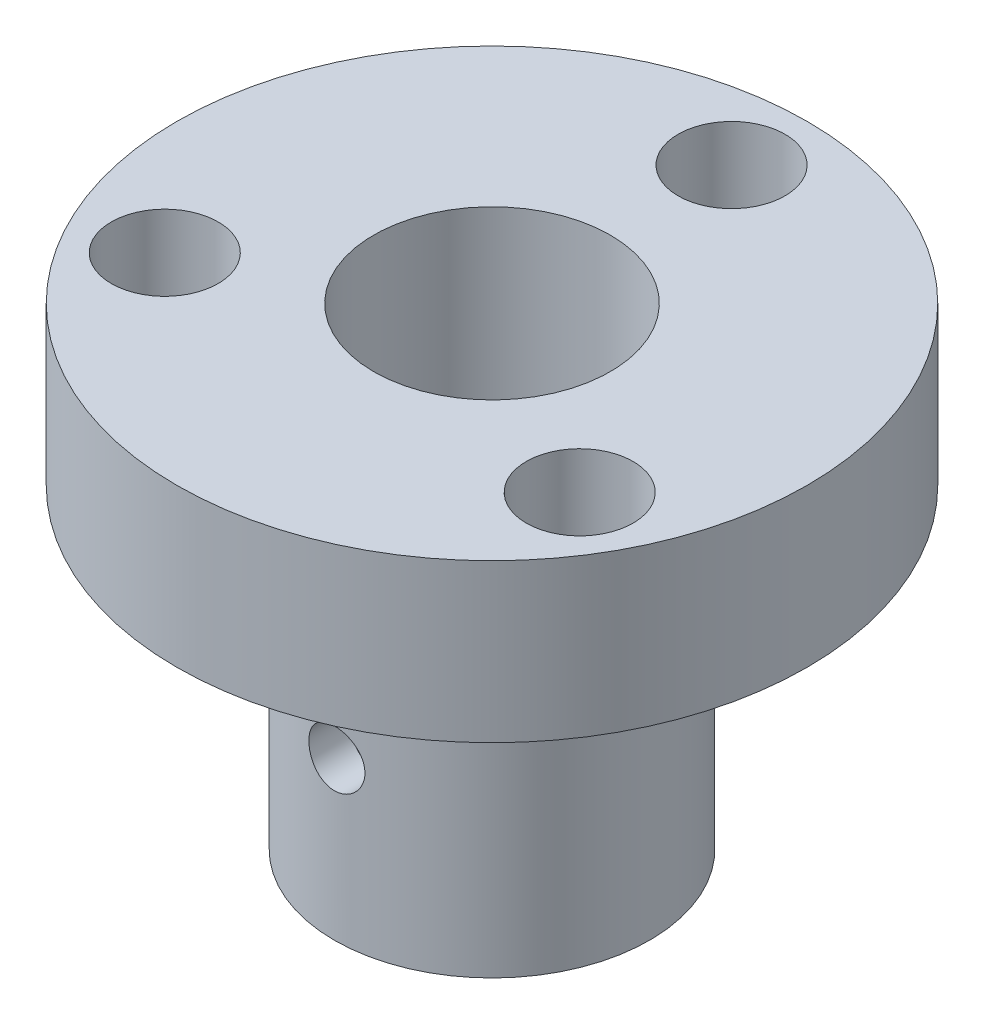
ISO-10303-21;
HEADER;
FILE_DESCRIPTION(('STEP AP214'),'2;1');
FILE_NAME('part.step','',(''),(''),'','','');
FILE_SCHEMA(('AUTOMOTIVE_DESIGN { 1 0 10303 214 1 1 1 1 }'));
ENDSEC;
DATA;
#1=APPLICATION_CONTEXT('core data for automotive mechanical design processes');
#2=APPLICATION_PROTOCOL_DEFINITION('international standard','automotive_design',2000,#1);
#3=PRODUCT_CONTEXT('',#1,'mechanical');
#4=PRODUCT('Part','Part','',(#3));
#5=PRODUCT_RELATED_PRODUCT_CATEGORY('part','',(#4));
#6=PRODUCT_DEFINITION_FORMATION('','',#4);
#7=PRODUCT_DEFINITION_CONTEXT('part definition',#1,'design');
#8=PRODUCT_DEFINITION('design','',#6,#7);
#9=PRODUCT_DEFINITION_SHAPE('','',#8);
#10=(LENGTH_UNIT() NAMED_UNIT(*) SI_UNIT(.MILLI.,.METRE.));
#11=(NAMED_UNIT(*) PLANE_ANGLE_UNIT() SI_UNIT($,.RADIAN.));
#12=(NAMED_UNIT(*) SI_UNIT($,.STERADIAN.) SOLID_ANGLE_UNIT());
#13=UNCERTAINTY_MEASURE_WITH_UNIT(LENGTH_MEASURE(1.E-05),#10,'distance_accuracy_value','');
#14=(GEOMETRIC_REPRESENTATION_CONTEXT(3) GLOBAL_UNCERTAINTY_ASSIGNED_CONTEXT((#13)) GLOBAL_UNIT_ASSIGNED_CONTEXT((#10,
#11,#12)) REPRESENTATION_CONTEXT('',''));
#15=CARTESIAN_POINT('',(0.,0.,0.));
#16=DIRECTION('',(0.,0.,1.));
#17=DIRECTION('',(1.,0.,0.));
#18=AXIS2_PLACEMENT_3D('',#15,#16,#17);
#19=CARTESIAN_POINT('',(0.,12.7,0.));
#20=DIRECTION('',(0.,-1.,0.));
#21=DIRECTION('',(0.,0.,-1.));
#22=AXIS2_PLACEMENT_3D('',#19,#20,#21);
#23=CYLINDRICAL_SURFACE('',#22,6.35);
#24=CARTESIAN_POINT('',(-1.1303,6.35,6.2485935945619));
#25=CARTESIAN_POINT('',(-1.13029752860319,6.4129474816605,6.24859477928636));
#26=CARTESIAN_POINT('',(-1.12502376655344,6.47592772669888,6.24955510147455));
#27=CARTESIAN_POINT('',(-1.10407989662448,6.60011645744907,6.253288450742));
#28=CARTESIAN_POINT('',(-1.08840060868597,6.66132332883139,6.25606307842284));
#29=CARTESIAN_POINT('',(-1.04713896619609,6.78015026397906,6.26310106017997));
#30=CARTESIAN_POINT('',(-1.02156538976728,6.83777345470071,6.26736309431536));
#31=CARTESIAN_POINT('',(-0.961263736790337,6.94790652333615,6.27689410394911));
#32=CARTESIAN_POINT('',(-0.926536522350173,7.00041688214925,6.28216298460781));
#33=CARTESIAN_POINT('',(-0.848497662550804,7.09942825016859,6.29318010060458));
#34=CARTESIAN_POINT('',(-0.80510320914681,7.14586352406258,6.29893262327816));
#35=CARTESIAN_POINT('',(-0.711140656114693,7.23083469001617,6.31023089151142));
#36=CARTESIAN_POINT('',(-0.66057210782028,7.26937008765047,6.31577662411108));
#37=CARTESIAN_POINT('',(-0.553267727306871,7.33769713569882,6.3260821366722));
#38=CARTESIAN_POINT('',(-0.496492076393623,7.36742717538406,6.33083628120179));
#39=CARTESIAN_POINT('',(-0.37865347562094,7.41690308225444,6.33897509325521));
#40=CARTESIAN_POINT('',(-0.317590843835827,7.4366496892748,6.34235986225469));
#41=CARTESIAN_POINT('',(-0.193591929496425,7.4653959469096,6.34734827608291));
#42=CARTESIAN_POINT('',(-0.130682049247929,7.47450625308372,6.34897024782024));
#43=CARTESIAN_POINT('',(-0.00420718696587975,7.4820657608453,6.35031338922828));
#44=CARTESIAN_POINT('',(0.0593577441923803,7.48051578423726,6.35003470542113));
#45=CARTESIAN_POINT('',(0.184580543784089,7.46688426227889,6.34762234490442));
#46=CARTESIAN_POINT('',(0.246251841595396,7.45492183576534,6.34550965008509));
#47=CARTESIAN_POINT('',(0.366697607884809,7.42099299078743,6.33969011077832));
#48=CARTESIAN_POINT('',(0.425471978630505,7.39902623506687,6.33598321254887));
#49=CARTESIAN_POINT('',(0.538805120450369,7.34559650342699,6.32735638635074));
#50=CARTESIAN_POINT('',(0.593340631871781,7.31408522290982,6.32243031191731));
#51=CARTESIAN_POINT('',(0.696394590932209,7.24249642495821,6.31191110570192));
#52=CARTESIAN_POINT('',(0.744912484459761,7.20241811958306,6.30631791258354));
#53=CARTESIAN_POINT('',(0.835258832297386,7.11417450408075,6.29499388871477));
#54=CARTESIAN_POINT('',(0.876985499299346,7.06590502301524,6.28926222422367));
#55=CARTESIAN_POINT('',(0.951765111250197,6.96299812033823,6.27838159660169));
#56=CARTESIAN_POINT('',(0.984817952788774,6.90836062281775,6.27323264041835));
#57=CARTESIAN_POINT('',(1.04133641697596,6.79414166467476,6.26409955120621));
#58=CARTESIAN_POINT('',(1.06478844399584,6.73455333578239,6.26011707226906));
#59=CARTESIAN_POINT('',(1.10132048259893,6.61219582604084,6.25379407198502));
#60=CARTESIAN_POINT('',(1.11440154509544,6.54942696816782,6.25145338427448));
#61=CARTESIAN_POINT('',(1.12967421074342,6.42340468476552,6.24871157429963));
#62=CARTESIAN_POINT('',(1.1320115149774,6.36016946405966,6.24828450262102));
#63=CARTESIAN_POINT('',(1.12611980656729,6.23421190744061,6.24934899119854));
#64=CARTESIAN_POINT('',(1.11789126229031,6.17148954891709,6.25084046640858));
#65=CARTESIAN_POINT('',(1.09122611970099,6.0488095478001,6.25554991782972));
#66=CARTESIAN_POINT('',(1.0728648576672,5.98883499749475,6.25875514695102));
#67=CARTESIAN_POINT('',(1.02653498701514,5.87281385159103,6.26652011136834));
#68=CARTESIAN_POINT('',(0.998565732092789,5.81676752053895,6.27107993778172));
#69=CARTESIAN_POINT('',(0.933474479097979,5.70954878726828,6.28109997867828));
#70=CARTESIAN_POINT('',(0.896259814835744,5.65843349045936,6.28656911125703));
#71=CARTESIAN_POINT('',(0.813860130740536,5.56312065938619,6.29776598333192));
#72=CARTESIAN_POINT('',(0.768674468015051,5.51892368365494,6.30349374365968));
#73=CARTESIAN_POINT('',(0.670967135208993,5.43816353360303,6.3146452745759));
#74=CARTESIAN_POINT('',(0.618364201269163,5.40169796577111,6.3200645909399));
#75=CARTESIAN_POINT('',(0.507694087392308,5.33812217243745,6.32991535892806));
#76=CARTESIAN_POINT('',(0.449627102767369,5.31101161270319,6.33434684584306));
#77=CARTESIAN_POINT('',(0.329956377996444,5.2670642471255,6.34170339516869));
#78=CARTESIAN_POINT('',(0.26837124516651,5.25017803607877,6.34463569095833));
#79=CARTESIAN_POINT('',(0.143182328625897,5.22700033003815,6.34869419748068));
#80=CARTESIAN_POINT('',(0.0795787360337635,5.22070783500608,6.34982057868977));
#81=CARTESIAN_POINT('',(-0.0469027850895825,5.2189281674832,6.35013741439244));
#82=CARTESIAN_POINT('',(-0.109778614269502,5.2232930711384,6.3493543717336));
#83=CARTESIAN_POINT('',(-0.233886077679075,5.24238221219445,6.34599495704242));
#84=CARTESIAN_POINT('',(-0.295117724437979,5.25710637063087,6.34341859867981));
#85=CARTESIAN_POINT('',(-0.414130647219045,5.29643628901858,6.3367614767518));
#86=CARTESIAN_POINT('',(-0.471916767035402,5.32102778217131,6.33268288590209));
#87=CARTESIAN_POINT('',(-0.582565157591162,5.37937720115281,6.32346454814741));
#88=CARTESIAN_POINT('',(-0.635427142672245,5.41313565833019,6.31832473973479));
#89=CARTESIAN_POINT('',(-0.735467702991129,5.48937711212491,6.30746821917931));
#90=CARTESIAN_POINT('',(-0.782563586469942,5.5319676821887,6.3017448838471));
#91=CARTESIAN_POINT('',(-0.868991600851841,5.62443981221691,6.29041003362776));
#92=CARTESIAN_POINT('',(-0.908321908493049,5.67432307964371,6.28479854527831));
#93=CARTESIAN_POINT('',(-0.978402705974915,5.78045289515873,6.2742726933168));
#94=CARTESIAN_POINT('',(-1.00908013748217,5.83674830361509,6.26936442851344));
#95=CARTESIAN_POINT('',(-1.06049430719683,5.95376063547626,6.26087346378715));
#96=CARTESIAN_POINT('',(-1.08124068756143,6.01447320395225,6.25728947888211));
#97=CARTESIAN_POINT('',(-1.10785061597257,6.12116068175458,6.2526226773509));
#98=CARTESIAN_POINT('',(-1.116255146414,6.16650046594738,6.2511204717796));
#99=CARTESIAN_POINT('',(-1.12748067941379,6.25788766220765,6.24910550811149));
#100=CARTESIAN_POINT('',(-1.13030180856719,6.30393505820726,6.24859272758101));
#101=CARTESIAN_POINT('',(-1.1303,6.35,6.2485935945619));
#102=B_SPLINE_CURVE_WITH_KNOTS('',3,(#24,#25,#26,#27,#28,#29,#30,#31,#32,#33,#34,#35,#36,#37,
#38,#39,#40,#41,#42,#43,#44,#45,#46,#47,#48,#49,#50,#51,#52,#53,#54,#55,#56,#57,#58,#59,#60,#61,
#62,#63,#64,#65,#66,#67,#68,#69,#70,#71,#72,#73,#74,#75,#76,#77,#78,#79,#80,#81,#82,#83,#84,#85,
#86,#87,#88,#89,#90,#91,#92,#93,#94,#95,#96,#97,#98,#99,#100,#101),.UNSPECIFIED.,.T.,.F.,(4,2,2,
2,2,2,2,2,2,2,2,2,2,2,2,2,2,2,2,2,2,2,2,2,2,2,2,2,2,2,2,2,2,2,2,2,2,2,4),(0.,0.188673929647673,
0.377514534626136,0.566187984707758,0.754843671490905,0.945396353842151,1.13596095857323,
1.32782903745417,1.51968289561749,1.70952248173693,1.89934743322768,2.08702890424999,
2.27471670267542,2.46337072228333,2.65204210056538,2.84332262546283,3.03460543072442,
3.22615818062714,3.41769151757453,3.60661956640559,3.79553924064846,3.98307286921062,
4.17061911513112,4.36012684649338,4.54964986939678,4.74143924348983,4.93322176468821,
5.12407001760689,5.3149002535955,5.5030968753489,5.69129206257059,5.87921612052189,
6.06715107352076,6.25752581883362,6.44794520878683,6.6399272609008,6.83172253573712,
6.96979717232728,7.10786867825189),.UNSPECIFIED.);
#103=CARTESIAN_POINT('',(-1.1303,6.35,6.2485935945619));
#104=VERTEX_POINT('',#103);
#105=EDGE_CURVE('E37',#104,#104,#102,.T.);
#106=ORIENTED_EDGE('',*,*,#105,.T.);
#107=EDGE_LOOP('',(#106));
#108=FACE_BOUND('',#107,.T.);
#109=CARTESIAN_POINT('',(0.,12.7,0.));
#110=DIRECTION('',(0.,1.,0.));
#111=DIRECTION('',(0.,0.,1.));
#112=AXIS2_PLACEMENT_3D('',#109,#110,#111);
#113=CIRCLE('',#112,6.35);
#114=CARTESIAN_POINT('',(0.,12.7,6.35));
#115=VERTEX_POINT('',#114);
#116=EDGE_CURVE('E10',#115,#115,#113,.T.);
#117=ORIENTED_EDGE('',*,*,#116,.F.);
#118=EDGE_LOOP('',(#117));
#119=FACE_BOUND('',#118,.T.);
#120=CARTESIAN_POINT('',(0.,0.,0.));
#121=DIRECTION('',(0.,1.,0.));
#122=DIRECTION('',(0.,0.,1.));
#123=AXIS2_PLACEMENT_3D('',#120,#121,#122);
#124=CIRCLE('',#123,6.35);
#125=CARTESIAN_POINT('',(0.,0.,6.35));
#126=VERTEX_POINT('',#125);
#127=EDGE_CURVE('E44',#126,#126,#124,.T.);
#128=ORIENTED_EDGE('',*,*,#127,.T.);
#129=EDGE_LOOP('',(#128));
#130=FACE_BOUND('',#129,.T.);
#131=ADVANCED_FACE('F33',(#108,#119,#130),#23,.T.);
#132=CARTESIAN_POINT('',(0.,0.,0.));
#133=DIRECTION('',(0.,1.,0.));
#134=DIRECTION('',(0.,0.,1.));
#135=AXIS2_PLACEMENT_3D('',#132,#133,#134);
#136=PLANE('',#135);
#137=CARTESIAN_POINT('',(0.,0.,0.));
#138=DIRECTION('',(0.,1.,0.));
#139=DIRECTION('',(0.,0.,1.));
#140=AXIS2_PLACEMENT_3D('',#137,#138,#139);
#141=CIRCLE('',#140,4.76758);
#142=CARTESIAN_POINT('',(0.,0.,4.76758));
#143=VERTEX_POINT('',#142);
#144=EDGE_CURVE('E54',#143,#143,#141,.T.);
#145=ORIENTED_EDGE('',*,*,#144,.T.);
#146=EDGE_LOOP('',(#145));
#147=FACE_BOUND('',#146,.T.);
#148=ORIENTED_EDGE('',*,*,#127,.F.);
#149=EDGE_LOOP('',(#148));
#150=FACE_BOUND('',#149,.T.);
#151=ADVANCED_FACE('F112',(#147,#150),#136,.F.);
#152=CARTESIAN_POINT('',(0.,12.7,0.));
#153=DIRECTION('',(0.,1.,0.));
#154=DIRECTION('',(0.,0.,1.));
#155=AXIS2_PLACEMENT_3D('',#152,#153,#154);
#156=PLANE('',#155);
#157=CARTESIAN_POINT('',(0.,12.7,-9.652));
#158=DIRECTION('',(0.,1.,0.));
#159=DIRECTION('',(0.,0.,1.));
#160=AXIS2_PLACEMENT_3D('',#157,#158,#159);
#161=CIRCLE('',#160,2.15265);
#162=CARTESIAN_POINT('',(0.,12.7,-7.49935));
#163=VERTEX_POINT('',#162);
#164=EDGE_CURVE('E74',#163,#163,#161,.T.);
#165=ORIENTED_EDGE('',*,*,#164,.T.);
#166=EDGE_LOOP('',(#165));
#167=FACE_BOUND('',#166,.T.);
#168=CARTESIAN_POINT('',(-8.35887719732738,12.7,4.82600000000004));
#169=DIRECTION('',(0.,1.,0.));
#170=DIRECTION('',(0.,0.,1.));
#171=AXIS2_PLACEMENT_3D('',#168,#169,#170);
#172=CIRCLE('',#171,2.15265);
#173=CARTESIAN_POINT('',(-8.35887719732738,12.7,6.97865000000004));
#174=VERTEX_POINT('',#173);
#175=EDGE_CURVE('E68',#174,#174,#172,.T.);
#176=ORIENTED_EDGE('',*,*,#175,.T.);
#177=EDGE_LOOP('',(#176));
#178=FACE_BOUND('',#177,.T.);
#179=CARTESIAN_POINT('',(8.35887719732738,12.7,4.82600000000004));
#180=DIRECTION('',(0.,1.,0.));
#181=DIRECTION('',(0.,0.,1.));
#182=AXIS2_PLACEMENT_3D('',#179,#180,#181);
#183=CIRCLE('',#182,2.15265);
#184=CARTESIAN_POINT('',(8.35887719732738,12.7,6.97865000000003));
#185=VERTEX_POINT('',#184);
#186=EDGE_CURVE('E60',#185,#185,#183,.T.);
#187=ORIENTED_EDGE('',*,*,#186,.T.);
#188=EDGE_LOOP('',(#187));
#189=FACE_BOUND('',#188,.T.);
#190=CARTESIAN_POINT('',(0.,12.7,0.));
#191=DIRECTION('',(0.,1.,0.));
#192=DIRECTION('',(0.,0.,1.));
#193=AXIS2_PLACEMENT_3D('',#190,#191,#192);
#194=CIRCLE('',#193,12.7);
#195=CARTESIAN_POINT('',(0.,12.7,12.7));
#196=VERTEX_POINT('',#195);
#197=EDGE_CURVE('E51',#196,#196,#194,.T.);
#198=ORIENTED_EDGE('',*,*,#197,.F.);
#199=EDGE_LOOP('',(#198));
#200=FACE_BOUND('',#199,.T.);
#201=ORIENTED_EDGE('',*,*,#116,.T.);
#202=EDGE_LOOP('',(#201));
#203=FACE_BOUND('',#202,.T.);
#204=ADVANCED_FACE('F117',(#167,#178,#189,#200,#203),#156,.F.);
#205=CARTESIAN_POINT('',(0.,19.05,0.));
#206=DIRECTION('',(0.,-1.,0.));
#207=DIRECTION('',(0.,0.,-1.));
#208=AXIS2_PLACEMENT_3D('',#205,#206,#207);
#209=CYLINDRICAL_SURFACE('',#208,12.7);
#210=CARTESIAN_POINT('',(0.,19.05,0.));
#211=DIRECTION('',(0.,1.,0.));
#212=DIRECTION('',(0.,0.,1.));
#213=AXIS2_PLACEMENT_3D('',#210,#211,#212);
#214=CIRCLE('',#213,12.7);
#215=CARTESIAN_POINT('',(0.,19.05,12.7));
#216=VERTEX_POINT('',#215);
#217=EDGE_CURVE('E49',#216,#216,#214,.T.);
#218=ORIENTED_EDGE('',*,*,#217,.F.);
#219=EDGE_LOOP('',(#218));
#220=FACE_BOUND('',#219,.T.);
#221=ORIENTED_EDGE('',*,*,#197,.T.);
#222=EDGE_LOOP('',(#221));
#223=FACE_BOUND('',#222,.T.);
#224=ADVANCED_FACE('F135',(#220,#223),#209,.T.);
#225=CARTESIAN_POINT('',(0.,19.05,0.));
#226=DIRECTION('',(0.,1.,0.));
#227=DIRECTION('',(0.,0.,1.));
#228=AXIS2_PLACEMENT_3D('',#225,#226,#227);
#229=PLANE('',#228);
#230=CARTESIAN_POINT('',(0.,19.05,-9.652));
#231=DIRECTION('',(0.,1.,0.));
#232=DIRECTION('',(0.,0.,1.));
#233=AXIS2_PLACEMENT_3D('',#230,#231,#232);
#234=CIRCLE('',#233,2.15265);
#235=CARTESIAN_POINT('',(0.,19.05,-7.49935));
#236=VERTEX_POINT('',#235);
#237=EDGE_CURVE('E77',#236,#236,#234,.T.);
#238=ORIENTED_EDGE('',*,*,#237,.F.);
#239=EDGE_LOOP('',(#238));
#240=FACE_BOUND('',#239,.T.);
#241=CARTESIAN_POINT('',(-8.35887719732738,19.05,4.82600000000004));
#242=DIRECTION('',(0.,1.,0.));
#243=DIRECTION('',(0.,0.,1.));
#244=AXIS2_PLACEMENT_3D('',#241,#242,#243);
#245=CIRCLE('',#244,2.15265);
#246=CARTESIAN_POINT('',(-8.35887719732738,19.05,6.97865000000004));
#247=VERTEX_POINT('',#246);
#248=EDGE_CURVE('E71',#247,#247,#245,.T.);
#249=ORIENTED_EDGE('',*,*,#248,.F.);
#250=EDGE_LOOP('',(#249));
#251=FACE_BOUND('',#250,.T.);
#252=CARTESIAN_POINT('',(8.35887719732738,19.05,4.82600000000004));
#253=DIRECTION('',(0.,1.,0.));
#254=DIRECTION('',(0.,0.,1.));
#255=AXIS2_PLACEMENT_3D('',#252,#253,#254);
#256=CIRCLE('',#255,2.15265);
#257=CARTESIAN_POINT('',(8.35887719732738,19.05,6.97865000000004));
#258=VERTEX_POINT('',#257);
#259=EDGE_CURVE('E65',#258,#258,#256,.T.);
#260=ORIENTED_EDGE('',*,*,#259,.F.);
#261=EDGE_LOOP('',(#260));
#262=FACE_BOUND('',#261,.T.);
#263=CARTESIAN_POINT('',(0.,19.05,0.));
#264=DIRECTION('',(0.,1.,0.));
#265=DIRECTION('',(0.,0.,1.));
#266=AXIS2_PLACEMENT_3D('',#263,#264,#265);
#267=CIRCLE('',#266,4.76758);
#268=CARTESIAN_POINT('',(0.,19.05,4.76758));
#269=VERTEX_POINT('',#268);
#270=EDGE_CURVE('E57',#269,#269,#267,.T.);
#271=ORIENTED_EDGE('',*,*,#270,.F.);
#272=EDGE_LOOP('',(#271));
#273=FACE_BOUND('',#272,.T.);
#274=ORIENTED_EDGE('',*,*,#217,.T.);
#275=EDGE_LOOP('',(#274));
#276=FACE_BOUND('',#275,.T.);
#277=ADVANCED_FACE('F108',(#240,#251,#262,#273,#276),#229,.T.);
#278=CARTESIAN_POINT('',(0.,0.,0.));
#279=DIRECTION('',(0.,1.,0.));
#280=DIRECTION('',(0.,0.,1.));
#281=AXIS2_PLACEMENT_3D('',#278,#279,#280);
#282=CYLINDRICAL_SURFACE('',#281,4.76758);
#283=CARTESIAN_POINT('',(0.,5.2197,4.76758));
#284=CARTESIAN_POINT('',(0.0625524058414924,5.21970193084232,4.76757888568314));
#285=CARTESIAN_POINT('',(0.125127098186318,5.22491010852738,4.76633656256058));
#286=CARTESIAN_POINT('',(0.248489906553298,5.24557812898572,4.76150089246402));
#287=CARTESIAN_POINT('',(0.309276871940467,5.26104442964688,4.75790606451563));
#288=CARTESIAN_POINT('',(0.427264355908841,5.30170982285277,4.74876439603588));
#289=CARTESIAN_POINT('',(0.484468858607829,5.32689787195789,4.74321977101343));
#290=CARTESIAN_POINT('',(0.593839483970573,5.38625450470629,4.7307723835204));
#291=CARTESIAN_POINT('',(0.646005562892928,5.42042316630575,4.72386960926053));
#292=CARTESIAN_POINT('',(0.744792782155422,5.49744513336606,4.70931421092425));
#293=CARTESIAN_POINT('',(0.79130647566178,5.54043425116134,4.70165096826963));
#294=CARTESIAN_POINT('',(0.87653563067149,5.63358571343386,4.68651066945842));
#295=CARTESIAN_POINT('',(0.915250294982354,5.68374879031566,4.67903363240358));
#296=CARTESIAN_POINT('',(0.984274306941059,5.79064143644958,4.66500633104685));
#297=CARTESIAN_POINT('',(1.01446595185179,5.84744894683104,4.6584696037687));
#298=CARTESIAN_POINT('',(1.06483080775784,5.96551252756314,4.64721689515964));
#299=CARTESIAN_POINT('',(1.08500544481656,6.02676796326432,4.64250065467785));
#300=CARTESIAN_POINT('',(1.11440193281012,6.15081370645423,4.6355316478263));
#301=CARTESIAN_POINT('',(1.12381573956728,6.21355604741308,4.63323576593506));
#302=CARTESIAN_POINT('',(1.1320208236683,6.33976825482429,4.63123818803435));
#303=CARTESIAN_POINT('',(1.130813645728,6.40323801413996,4.63153611478132));
#304=CARTESIAN_POINT('',(1.11796474417215,6.52765141751584,4.63465361511795));
#305=CARTESIAN_POINT('',(1.10654925432487,6.58862000731689,4.63741851340828));
#306=CARTESIAN_POINT('',(1.07396760577446,6.70775117149921,4.64507158654718));
#307=CARTESIAN_POINT('',(1.05280081515946,6.76591356376107,4.64995989899782));
#308=CARTESIAN_POINT('',(1.00111828869584,6.87840047613239,4.66136076625657));
#309=CARTESIAN_POINT('',(0.970518369318639,6.9326847842406,4.66788784431785));
#310=CARTESIAN_POINT('',(0.900897207532268,7.03543039157134,4.68182230972949));
#311=CARTESIAN_POINT('',(0.861874629480849,7.0838907653506,4.68922983661522));
#312=CARTESIAN_POINT('',(0.775332959887324,7.17491202601966,4.70432266185229));
#313=CARTESIAN_POINT('',(0.727622310008605,7.21729061493288,4.71201022244166));
#314=CARTESIAN_POINT('',(0.625681099872622,7.29347779676572,4.72662559567478));
#315=CARTESIAN_POINT('',(0.571450377968597,7.32728617714664,4.73355338947412));
#316=CARTESIAN_POINT('',(0.457764489292095,7.38543067934072,4.74589770143639));
#317=CARTESIAN_POINT('',(0.398294934195047,7.40973965024404,4.75130987538831));
#318=CARTESIAN_POINT('',(0.275957341437764,7.44796659236006,4.75998131439382));
#319=CARTESIAN_POINT('',(0.213089888665993,7.46188634582398,4.76324094870058));
#320=CARTESIAN_POINT('',(0.0873018412734605,7.47866701359783,4.76718628173408));
#321=CARTESIAN_POINT('',(0.0244161742552055,7.48177649869878,4.7679298244795));
#322=CARTESIAN_POINT('',(-0.100976449140018,7.47752668688891,4.7669228094121));
#323=CARTESIAN_POINT('',(-0.163483435563953,7.47016823179389,4.76517245215489));
#324=CARTESIAN_POINT('',(-0.285497778788292,7.44539690567029,4.7594111428399));
#325=CARTESIAN_POINT('',(-0.345033756336252,7.42811740541598,4.7554301938918));
#326=CARTESIAN_POINT('',(-0.460360538553933,7.38414498120892,4.74565481028302));
#327=CARTESIAN_POINT('',(-0.516150987842508,7.35745116551064,4.7398602038344));
#328=CARTESIAN_POINT('',(-0.623408758447266,7.29491072700109,4.72695978364888));
#329=CARTESIAN_POINT('',(-0.674790755293286,7.25892195916578,4.7198341304949));
#330=CARTESIAN_POINT('',(-0.77087496417983,7.17899719542512,4.70509700215467));
#331=CARTESIAN_POINT('',(-0.815576143975616,7.13505997372744,4.69748545215185));
#332=CARTESIAN_POINT('',(-0.898036628852286,7.03933666938004,4.68242971168702));
#333=CARTESIAN_POINT('',(-0.935622452191612,6.98739975905363,4.67499283784952));
#334=CARTESIAN_POINT('',(-1.00154193624881,6.87780687164487,4.66131640938934));
#335=CARTESIAN_POINT('',(-1.02987601093222,6.82015115059881,4.65507680120068));
#336=CARTESIAN_POINT('',(-1.07628281730024,6.701072026035,4.64456680434952));
#337=CARTESIAN_POINT('',(-1.09441585682302,6.6396731962946,4.64028487085787));
#338=CARTESIAN_POINT('',(-1.12007359207612,6.51458316456753,4.63415919448729));
#339=CARTESIAN_POINT('',(-1.12760033375709,6.4508924071244,4.63231498137733));
#340=CARTESIAN_POINT('',(-1.13173320157672,6.32478453572057,4.6313067861145));
#341=CARTESIAN_POINT('',(-1.12861558580075,6.26237686457289,4.63207500030485));
#342=CARTESIAN_POINT('',(-1.11217421706066,6.13900394749625,4.63604979910636));
#343=CARTESIAN_POINT('',(-1.09885063072876,6.07803867803405,4.63925634390704));
#344=CARTESIAN_POINT('',(-1.06251919408861,5.95954685975541,4.64771069318547));
#345=CARTESIAN_POINT('',(-1.0395582040923,5.90200518969512,4.65294861119475));
#346=CARTESIAN_POINT('',(-0.984641788092935,5.7915521880276,4.66487788538148));
#347=CARTESIAN_POINT('',(-0.952685242843283,5.73864143368361,4.67156942239771));
#348=CARTESIAN_POINT('',(-0.879797350919583,5.63760556507867,4.68584925686423));
#349=CARTESIAN_POINT('',(-0.838672053752488,5.58962280618225,4.69345498656145));
#350=CARTESIAN_POINT('',(-0.748998593231899,5.50114934265285,4.70859681825466));
#351=CARTESIAN_POINT('',(-0.700448693828069,5.46066039515966,4.71613290352794));
#352=CARTESIAN_POINT('',(-0.596376595118508,5.38770315899086,4.73042842717735));
#353=CARTESIAN_POINT('',(-0.540756166309731,5.35537202460958,4.73717367827902));
#354=CARTESIAN_POINT('',(-0.42471762177434,5.30057006701792,4.748981317852));
#355=CARTESIAN_POINT('',(-0.364303241554323,5.27809165384223,4.75404500097436));
#356=CARTESIAN_POINT('',(-0.253266860984691,5.24726017254508,4.761103169873));
#357=CARTESIAN_POINT('',(-0.203206673031568,5.23694629143181,4.76351601464223));
#358=CARTESIAN_POINT('',(-0.102102566457941,5.22316562468425,4.76675483638665));
#359=CARTESIAN_POINT('',(-0.0510587076662017,5.2196984239405,4.7675809095666));
#360=CARTESIAN_POINT('',(0.,5.2197,4.76758));
#361=B_SPLINE_CURVE_WITH_KNOTS('',3,(#283,#284,#285,#286,#287,#288,#289,#290,#291,#292,#293,
#294,#295,#296,#297,#298,#299,#300,#301,#302,#303,#304,#305,#306,#307,#308,#309,#310,#311,#312,
#313,#314,#315,#316,#317,#318,#319,#320,#321,#322,#323,#324,#325,#326,#327,#328,#329,#330,#331,
#332,#333,#334,#335,#336,#337,#338,#339,#340,#341,#342,#343,#344,#345,#346,#347,#348,#349,#350,
#351,#352,#353,#354,#355,#356,#357,#358,#359,#360),.UNSPECIFIED.,.T.,.F.,(4,2,2,2,2,2,2,2,2,2,2,
2,2,2,2,2,2,2,2,2,2,2,2,2,2,2,2,2,2,2,2,2,2,2,2,2,2,2,4),(0.,0.187470200794151,
0.375058533542777,0.56243439914393,0.749811891314547,0.940326241693303,1.13086005598579,
1.32390905636407,1.51693056558797,1.70645234650946,1.89594656384171,2.08134256770728,
2.26675058744879,2.45386363233188,2.64100637091985,2.83292906546866,3.02485651917985,
3.21732859029974,3.40976763559459,3.59775137378109,3.78571999545652,3.97121898015836,
4.15673554047055,4.34527706333458,4.53384768746529,4.7265483377905,4.91924036462547,
5.11078090400512,5.30228449023071,5.48885607848821,5.67542462066832,5.86109632437587,
6.04679113998049,6.23686695298859,6.42698727843469,6.62011805032187,6.81309978285714,
6.96613253108733,7.11915600076375),.UNSPECIFIED.);
#362=CARTESIAN_POINT('',(0.,5.2197,4.76758));
#363=VERTEX_POINT('',#362);
#364=EDGE_CURVE('E80',#363,#363,#361,.T.);
#365=ORIENTED_EDGE('',*,*,#364,.T.);
#366=EDGE_LOOP('',(#365));
#367=FACE_BOUND('',#366,.T.);
#368=ORIENTED_EDGE('',*,*,#144,.F.);
#369=EDGE_LOOP('',(#368));
#370=FACE_BOUND('',#369,.T.);
#371=ORIENTED_EDGE('',*,*,#270,.T.);
#372=EDGE_LOOP('',(#371));
#373=FACE_BOUND('',#372,.T.);
#374=ADVANCED_FACE('F85',(#367,#370,#373),#282,.F.);
#375=CARTESIAN_POINT('',(8.35887719732738,19.05,4.82600000000004));
#376=DIRECTION('',(0.,1.,0.));
#377=DIRECTION('',(0.,0.,1.));
#378=AXIS2_PLACEMENT_3D('',#375,#376,#377);
#379=CYLINDRICAL_SURFACE('',#378,2.15265);
#380=ORIENTED_EDGE('',*,*,#259,.T.);
#381=EDGE_LOOP('',(#380));
#382=FACE_BOUND('',#381,.T.);
#383=ORIENTED_EDGE('',*,*,#186,.F.);
#384=EDGE_LOOP('',(#383));
#385=FACE_BOUND('',#384,.T.);
#386=ADVANCED_FACE('F101',(#382,#385),#379,.F.);
#387=CARTESIAN_POINT('',(-8.35887719732738,19.05,4.82600000000004));
#388=DIRECTION('',(0.,1.,0.));
#389=DIRECTION('',(0.,0.,1.));
#390=AXIS2_PLACEMENT_3D('',#387,#388,#389);
#391=CYLINDRICAL_SURFACE('',#390,2.15265);
#392=ORIENTED_EDGE('',*,*,#248,.T.);
#393=EDGE_LOOP('',(#392));
#394=FACE_BOUND('',#393,.T.);
#395=ORIENTED_EDGE('',*,*,#175,.F.);
#396=EDGE_LOOP('',(#395));
#397=FACE_BOUND('',#396,.T.);
#398=ADVANCED_FACE('F98',(#394,#397),#391,.F.);
#399=CARTESIAN_POINT('',(0.,19.05,-9.652));
#400=DIRECTION('',(0.,1.,0.));
#401=DIRECTION('',(0.,0.,1.));
#402=AXIS2_PLACEMENT_3D('',#399,#400,#401);
#403=CYLINDRICAL_SURFACE('',#402,2.15265);
#404=ORIENTED_EDGE('',*,*,#237,.T.);
#405=EDGE_LOOP('',(#404));
#406=FACE_BOUND('',#405,.T.);
#407=ORIENTED_EDGE('',*,*,#164,.F.);
#408=EDGE_LOOP('',(#407));
#409=FACE_BOUND('',#408,.T.);
#410=ADVANCED_FACE('F93',(#406,#409),#403,.F.);
#411=CARTESIAN_POINT('',(0.,6.35,0.));
#412=DIRECTION('',(0.,0.,-1.));
#413=DIRECTION('',(-1.,0.,0.));
#414=AXIS2_PLACEMENT_3D('',#411,#412,#413);
#415=CYLINDRICAL_SURFACE('',#414,1.1303);
#416=ORIENTED_EDGE('',*,*,#105,.F.);
#417=EDGE_LOOP('',(#416));
#418=FACE_BOUND('',#417,.T.);
#419=ORIENTED_EDGE('',*,*,#364,.F.);
#420=EDGE_LOOP('',(#419));
#421=FACE_BOUND('',#420,.T.);
#422=ADVANCED_FACE('F89',(#418,#421),#415,.F.);
#423=CLOSED_SHELL('',(#131,#151,#204,#224,#277,#374,#386,#398,#410,#422));
#424=MANIFOLD_SOLID_BREP('B2',#423);
#425=ADVANCED_BREP_SHAPE_REPRESENTATION('',(#18,#424),#14);
#426=SHAPE_DEFINITION_REPRESENTATION(#9,#425);
ENDSEC;
END-ISO-10303-21;
